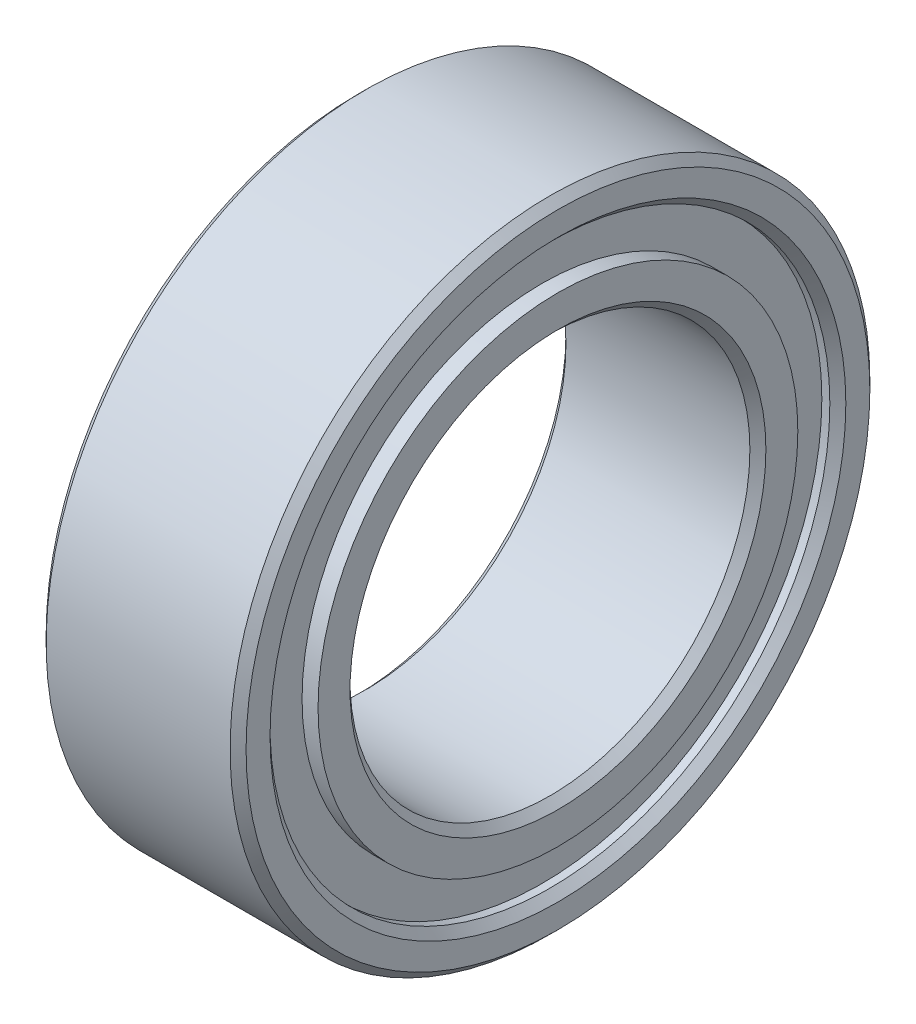
ISO-10303-21;
HEADER;
FILE_DESCRIPTION(('STEP AP214'),'2;1');
FILE_NAME('part.step','',(''),(''),'','','');
FILE_SCHEMA(('AUTOMOTIVE_DESIGN { 1 0 10303 214 1 1 1 1 }'));
ENDSEC;
DATA;
#1=APPLICATION_CONTEXT('core data for automotive mechanical design processes');
#2=APPLICATION_PROTOCOL_DEFINITION('international standard','automotive_design',2000,#1);
#3=PRODUCT_CONTEXT('',#1,'mechanical');
#4=PRODUCT('Part','Part','',(#3));
#5=PRODUCT_RELATED_PRODUCT_CATEGORY('part','',(#4));
#6=PRODUCT_DEFINITION_FORMATION('','',#4);
#7=PRODUCT_DEFINITION_CONTEXT('part definition',#1,'design');
#8=PRODUCT_DEFINITION('design','',#6,#7);
#9=PRODUCT_DEFINITION_SHAPE('','',#8);
#10=(LENGTH_UNIT() NAMED_UNIT(*) SI_UNIT(.MILLI.,.METRE.));
#11=(NAMED_UNIT(*) PLANE_ANGLE_UNIT() SI_UNIT($,.RADIAN.));
#12=(NAMED_UNIT(*) SI_UNIT($,.STERADIAN.) SOLID_ANGLE_UNIT());
#13=UNCERTAINTY_MEASURE_WITH_UNIT(LENGTH_MEASURE(1.E-05),#10,'distance_accuracy_value','');
#14=(GEOMETRIC_REPRESENTATION_CONTEXT(3) GLOBAL_UNCERTAINTY_ASSIGNED_CONTEXT((#13)) GLOBAL_UNIT_ASSIGNED_CONTEXT((#10,
#11,#12)) REPRESENTATION_CONTEXT('',''));
#15=CARTESIAN_POINT('',(0.,0.,0.));
#16=DIRECTION('',(0.,0.,1.));
#17=DIRECTION('',(1.,0.,0.));
#18=AXIS2_PLACEMENT_3D('',#15,#16,#17);
#19=CARTESIAN_POINT('',(0.,0.,0.));
#20=DIRECTION('',(1.,0.,0.));
#21=DIRECTION('',(0.,0.,-1.));
#22=AXIS2_PLACEMENT_3D('',#19,#20,#21);
#23=PLANE('',#22);
#24=CARTESIAN_POINT('',(0.,0.,-0.0491231883012408));
#25=DIRECTION('',(1.,0.,0.));
#26=DIRECTION('',(0.,0.,-1.));
#27=AXIS2_PLACEMENT_3D('',#24,#25,#26);
#28=CIRCLE('',#27,2.85087681169876);
#29=CARTESIAN_POINT('',(0.,0.,-2.9));
#30=VERTEX_POINT('',#29);
#31=EDGE_CURVE('E44',#30,#30,#28,.F.);
#32=ORIENTED_EDGE('',*,*,#31,.T.);
#33=EDGE_LOOP('',(#32));
#34=FACE_BOUND('',#33,.T.);
#35=CARTESIAN_POINT('',(0.,0.,0.));
#36=DIRECTION('',(1.,0.,0.));
#37=DIRECTION('',(0.,0.,-1.));
#38=AXIS2_PLACEMENT_3D('',#35,#36,#37);
#39=CIRCLE('',#38,2.6);
#40=CARTESIAN_POINT('',(0.,0.,-2.6));
#41=VERTEX_POINT('',#40);
#42=EDGE_CURVE('E48',#41,#41,#39,.T.);
#43=ORIENTED_EDGE('',*,*,#42,.T.);
#44=EDGE_LOOP('',(#43));
#45=FACE_BOUND('',#44,.T.);
#46=ADVANCED_FACE('F33',(#34,#45),#23,.F.);
#47=CARTESIAN_POINT('',(2.5,0.,0.));
#48=DIRECTION('',(1.,0.,0.));
#49=DIRECTION('',(0.,0.,-1.));
#50=AXIS2_PLACEMENT_3D('',#47,#48,#49);
#51=PLANE('',#50);
#52=CARTESIAN_POINT('',(2.5,0.,0.));
#53=DIRECTION('',(1.,0.,0.));
#54=DIRECTION('',(0.,0.,-1.));
#55=AXIS2_PLACEMENT_3D('',#52,#53,#54);
#56=CIRCLE('',#55,2.6);
#57=CARTESIAN_POINT('',(2.5,0.,-2.6));
#58=VERTEX_POINT('',#57);
#59=EDGE_CURVE('E62',#58,#58,#56,.F.);
#60=ORIENTED_EDGE('',*,*,#59,.T.);
#61=EDGE_LOOP('',(#60));
#62=FACE_BOUND('',#61,.T.);
#63=CARTESIAN_POINT('',(2.5,0.,0.000375624504543939));
#64=DIRECTION('',(1.,0.,0.));
#65=DIRECTION('',(0.,0.,-1.));
#66=AXIS2_PLACEMENT_3D('',#63,#64,#65);
#67=CIRCLE('',#66,2.99962437549546);
#68=CARTESIAN_POINT('',(2.5,0.,-2.99924875099091));
#69=VERTEX_POINT('',#68);
#70=EDGE_CURVE('E87',#69,#69,#67,.T.);
#71=ORIENTED_EDGE('',*,*,#70,.T.);
#72=EDGE_LOOP('',(#71));
#73=FACE_BOUND('',#72,.T.);
#74=ADVANCED_FACE('F118',(#62,#73),#51,.T.);
#75=CARTESIAN_POINT('',(2.5,0.,0.));
#76=DIRECTION('',(1.,0.,0.));
#77=DIRECTION('',(0.,0.,-1.));
#78=AXIS2_PLACEMENT_3D('',#75,#76,#77);
#79=CIRCLE('',#78,3.9);
#80=CARTESIAN_POINT('',(2.5,0.,-3.9));
#81=VERTEX_POINT('',#80);
#82=EDGE_CURVE('E77',#81,#81,#79,.T.);
#83=ORIENTED_EDGE('',*,*,#82,.T.);
#84=EDGE_LOOP('',(#83));
#85=FACE_BOUND('',#84,.T.);
#86=CARTESIAN_POINT('',(2.5,0.,0.000375624504543939));
#87=DIRECTION('',(1.,0.,0.));
#88=DIRECTION('',(0.,0.,-1.));
#89=AXIS2_PLACEMENT_3D('',#86,#87,#88);
#90=CIRCLE('',#89,3.6);
#91=CARTESIAN_POINT('',(2.5,0.,-3.59962437549546));
#92=VERTEX_POINT('',#91);
#93=EDGE_CURVE('E80',#92,#92,#90,.F.);
#94=ORIENTED_EDGE('',*,*,#93,.T.);
#95=EDGE_LOOP('',(#94));
#96=FACE_BOUND('',#95,.T.);
#97=ADVANCED_FACE('F125',(#85,#96),#51,.T.);
#98=CARTESIAN_POINT('',(0.,0.,0.));
#99=DIRECTION('',(1.,0.,0.));
#100=DIRECTION('',(0.,0.,-1.));
#101=AXIS2_PLACEMENT_3D('',#98,#99,#100);
#102=CIRCLE('',#101,3.9);
#103=CARTESIAN_POINT('',(0.,0.,-3.9));
#104=VERTEX_POINT('',#103);
#105=EDGE_CURVE('E53',#104,#104,#102,.F.);
#106=ORIENTED_EDGE('',*,*,#105,.T.);
#107=EDGE_LOOP('',(#106));
#108=FACE_BOUND('',#107,.T.);
#109=CARTESIAN_POINT('',(0.,0.,-0.0491231883012408));
#110=DIRECTION('',(1.,0.,0.));
#111=DIRECTION('',(0.,0.,-1.));
#112=AXIS2_PLACEMENT_3D('',#109,#110,#111);
#113=CIRCLE('',#112,3.6);
#114=CARTESIAN_POINT('',(0.,0.,-3.64912318830124));
#115=VERTEX_POINT('',#114);
#116=EDGE_CURVE('E56',#115,#115,#113,.T.);
#117=ORIENTED_EDGE('',*,*,#116,.T.);
#118=EDGE_LOOP('',(#117));
#119=FACE_BOUND('',#118,.T.);
#120=ADVANCED_FACE('F121',(#108,#119),#23,.F.);
#121=CARTESIAN_POINT('',(2.5,0.,0.));
#122=DIRECTION('',(-1.,0.,0.));
#123=DIRECTION('',(0.,0.,1.));
#124=AXIS2_PLACEMENT_3D('',#121,#122,#123);
#125=CYLINDRICAL_SURFACE('',#124,4.);
#126=CARTESIAN_POINT('',(2.4,0.,0.));
#127=DIRECTION('',(1.,0.,0.));
#128=DIRECTION('',(0.,0.,-1.));
#129=AXIS2_PLACEMENT_3D('',#126,#127,#128);
#130=CIRCLE('',#129,4.);
#131=CARTESIAN_POINT('',(2.4,0.,-4.));
#132=VERTEX_POINT('',#131);
#133=EDGE_CURVE('E71',#132,#132,#130,.F.);
#134=ORIENTED_EDGE('',*,*,#133,.T.);
#135=EDGE_LOOP('',(#134));
#136=FACE_BOUND('',#135,.T.);
#137=CARTESIAN_POINT('',(0.0999999999999994,0.,0.));
#138=DIRECTION('',(1.,0.,0.));
#139=DIRECTION('',(0.,0.,-1.));
#140=AXIS2_PLACEMENT_3D('',#137,#138,#139);
#141=CIRCLE('',#140,4.);
#142=CARTESIAN_POINT('',(0.0999999999999994,0.,-4.));
#143=VERTEX_POINT('',#142);
#144=EDGE_CURVE('E74',#143,#143,#141,.T.);
#145=ORIENTED_EDGE('',*,*,#144,.T.);
#146=EDGE_LOOP('',(#145));
#147=FACE_BOUND('',#146,.T.);
#148=ADVANCED_FACE('F131',(#136,#147),#125,.T.);
#149=CARTESIAN_POINT('',(2.5,0.,0.));
#150=DIRECTION('',(-1.,0.,0.));
#151=DIRECTION('',(0.,0.,1.));
#152=AXIS2_PLACEMENT_3D('',#149,#150,#151);
#153=CYLINDRICAL_SURFACE('',#152,2.5);
#154=CARTESIAN_POINT('',(2.4,0.,0.));
#155=DIRECTION('',(1.,0.,0.));
#156=DIRECTION('',(0.,0.,-1.));
#157=AXIS2_PLACEMENT_3D('',#154,#155,#156);
#158=CIRCLE('',#157,2.5);
#159=CARTESIAN_POINT('',(2.4,0.,-2.5));
#160=VERTEX_POINT('',#159);
#161=EDGE_CURVE('E65',#160,#160,#158,.T.);
#162=ORIENTED_EDGE('',*,*,#161,.T.);
#163=EDGE_LOOP('',(#162));
#164=FACE_BOUND('',#163,.T.);
#165=CARTESIAN_POINT('',(0.0999999999999994,0.,0.));
#166=DIRECTION('',(1.,0.,0.));
#167=DIRECTION('',(0.,0.,-1.));
#168=AXIS2_PLACEMENT_3D('',#165,#166,#167);
#169=CIRCLE('',#168,2.5);
#170=CARTESIAN_POINT('',(0.0999999999999994,0.,-2.5));
#171=VERTEX_POINT('',#170);
#172=EDGE_CURVE('E68',#171,#171,#169,.F.);
#173=ORIENTED_EDGE('',*,*,#172,.T.);
#174=EDGE_LOOP('',(#173));
#175=FACE_BOUND('',#174,.T.);
#176=ADVANCED_FACE('F137',(#164,#175),#153,.F.);
#177=CARTESIAN_POINT('',(2.3,0.,0.000375624504543939));
#178=DIRECTION('',(1.,0.,0.));
#179=DIRECTION('',(0.,0.,-1.));
#180=AXIS2_PLACEMENT_3D('',#177,#178,#179);
#181=CYLINDRICAL_SURFACE('',#180,3.5);
#182=CARTESIAN_POINT('',(2.4,0.,0.000375624504543939));
#183=DIRECTION('',(1.,0.,0.));
#184=DIRECTION('',(0.,0.,-1.));
#185=AXIS2_PLACEMENT_3D('',#182,#183,#184);
#186=CIRCLE('',#185,3.5);
#187=CARTESIAN_POINT('',(2.4,0.,-3.49962437549546));
#188=VERTEX_POINT('',#187);
#189=EDGE_CURVE('E59',#188,#188,#186,.T.);
#190=ORIENTED_EDGE('',*,*,#189,.T.);
#191=EDGE_LOOP('',(#190));
#192=FACE_BOUND('',#191,.T.);
#193=CARTESIAN_POINT('',(2.3,0.,0.000375624504543939));
#194=DIRECTION('',(1.,0.,0.));
#195=DIRECTION('',(0.,0.,-1.));
#196=AXIS2_PLACEMENT_3D('',#193,#194,#195);
#197=CIRCLE('',#196,3.5);
#198=CARTESIAN_POINT('',(2.3,0.,-3.49962437549546));
#199=VERTEX_POINT('',#198);
#200=EDGE_CURVE('E83',#199,#199,#197,.T.);
#201=ORIENTED_EDGE('',*,*,#200,.F.);
#202=EDGE_LOOP('',(#201));
#203=FACE_BOUND('',#202,.T.);
#204=ADVANCED_FACE('F187',(#192,#203),#181,.F.);
#205=CARTESIAN_POINT('',(2.3,0.,0.000375624504543939));
#206=DIRECTION('',(1.,0.,0.));
#207=DIRECTION('',(0.,0.,-1.));
#208=AXIS2_PLACEMENT_3D('',#205,#206,#207);
#209=PLANE('',#208);
#210=CARTESIAN_POINT('',(2.3,0.,0.000375624504543939));
#211=DIRECTION('',(1.,0.,0.));
#212=DIRECTION('',(0.,0.,-1.));
#213=AXIS2_PLACEMENT_3D('',#210,#211,#212);
#214=CIRCLE('',#213,2.99962437549546);
#215=CARTESIAN_POINT('',(2.3,0.,-2.99924875099091));
#216=VERTEX_POINT('',#215);
#217=EDGE_CURVE('E86',#216,#216,#214,.T.);
#218=ORIENTED_EDGE('',*,*,#217,.F.);
#219=EDGE_LOOP('',(#218));
#220=FACE_BOUND('',#219,.T.);
#221=ORIENTED_EDGE('',*,*,#200,.T.);
#222=EDGE_LOOP('',(#221));
#223=FACE_BOUND('',#222,.T.);
#224=ADVANCED_FACE('F114',(#220,#223),#209,.T.);
#225=CARTESIAN_POINT('',(2.3,0.,0.000375624504543939));
#226=DIRECTION('',(1.,0.,0.));
#227=DIRECTION('',(0.,0.,-1.));
#228=AXIS2_PLACEMENT_3D('',#225,#226,#227);
#229=CYLINDRICAL_SURFACE('',#228,2.99962437549546);
#230=ORIENTED_EDGE('',*,*,#217,.T.);
#231=EDGE_LOOP('',(#230));
#232=FACE_BOUND('',#231,.T.);
#233=ORIENTED_EDGE('',*,*,#70,.F.);
#234=EDGE_LOOP('',(#233));
#235=FACE_BOUND('',#234,.T.);
#236=ADVANCED_FACE('F109',(#232,#235),#229,.T.);
#237=CARTESIAN_POINT('',(0.2,0.,-0.0491231883012408));
#238=DIRECTION('',(-1.,0.,0.));
#239=DIRECTION('',(0.,0.,1.));
#240=AXIS2_PLACEMENT_3D('',#237,#238,#239);
#241=CYLINDRICAL_SURFACE('',#240,3.5);
#242=CARTESIAN_POINT('',(0.100000000000001,0.,-0.0491231883012408));
#243=DIRECTION('',(1.,0.,0.));
#244=DIRECTION('',(0.,0.,-1.));
#245=AXIS2_PLACEMENT_3D('',#242,#243,#244);
#246=CIRCLE('',#245,3.5);
#247=CARTESIAN_POINT('',(0.100000000000001,0.,-3.54912318830124));
#248=VERTEX_POINT('',#247);
#249=EDGE_CURVE('E10',#248,#248,#246,.F.);
#250=ORIENTED_EDGE('',*,*,#249,.T.);
#251=EDGE_LOOP('',(#250));
#252=FACE_BOUND('',#251,.T.);
#253=CARTESIAN_POINT('',(0.2,0.,-0.0491231883012408));
#254=DIRECTION('',(-1.,0.,0.));
#255=DIRECTION('',(0.,0.,1.));
#256=AXIS2_PLACEMENT_3D('',#253,#254,#255);
#257=CIRCLE('',#256,3.5);
#258=CARTESIAN_POINT('',(0.2,0.,3.45087681169876));
#259=VERTEX_POINT('',#258);
#260=EDGE_CURVE('E90',#259,#259,#257,.T.);
#261=ORIENTED_EDGE('',*,*,#260,.F.);
#262=EDGE_LOOP('',(#261));
#263=FACE_BOUND('',#262,.T.);
#264=ADVANCED_FACE('F104',(#252,#263),#241,.F.);
#265=CARTESIAN_POINT('',(0.2,0.,-0.0491231883012408));
#266=DIRECTION('',(-1.,0.,0.));
#267=DIRECTION('',(0.,0.,1.));
#268=AXIS2_PLACEMENT_3D('',#265,#266,#267);
#269=PLANE('',#268);
#270=CARTESIAN_POINT('',(0.2,0.,-0.0491231883012408));
#271=DIRECTION('',(-1.,0.,0.));
#272=DIRECTION('',(0.,0.,1.));
#273=AXIS2_PLACEMENT_3D('',#270,#271,#272);
#274=CIRCLE('',#273,2.95087681169876);
#275=CARTESIAN_POINT('',(0.2,0.,2.90175362339752));
#276=VERTEX_POINT('',#275);
#277=EDGE_CURVE('E95',#276,#276,#274,.T.);
#278=ORIENTED_EDGE('',*,*,#277,.F.);
#279=EDGE_LOOP('',(#278));
#280=FACE_BOUND('',#279,.T.);
#281=ORIENTED_EDGE('',*,*,#260,.T.);
#282=EDGE_LOOP('',(#281));
#283=FACE_BOUND('',#282,.T.);
#284=ADVANCED_FACE('F101',(#280,#283),#269,.T.);
#285=CARTESIAN_POINT('',(0.2,0.,-0.0491231883012408));
#286=DIRECTION('',(-1.,0.,0.));
#287=DIRECTION('',(0.,0.,1.));
#288=AXIS2_PLACEMENT_3D('',#285,#286,#287);
#289=CYLINDRICAL_SURFACE('',#288,2.95087681169876);
#290=CARTESIAN_POINT('',(0.100000000000002,0.,-0.0491231883012408));
#291=DIRECTION('',(1.,0.,0.));
#292=DIRECTION('',(0.,0.,-1.));
#293=AXIS2_PLACEMENT_3D('',#290,#291,#292);
#294=CIRCLE('',#293,2.95087681169876);
#295=CARTESIAN_POINT('',(0.100000000000002,0.,-3.));
#296=VERTEX_POINT('',#295);
#297=EDGE_CURVE('E40',#296,#296,#294,.T.);
#298=ORIENTED_EDGE('',*,*,#297,.T.);
#299=EDGE_LOOP('',(#298));
#300=FACE_BOUND('',#299,.T.);
#301=ORIENTED_EDGE('',*,*,#277,.T.);
#302=EDGE_LOOP('',(#301));
#303=FACE_BOUND('',#302,.T.);
#304=ADVANCED_FACE('F99',(#300,#303),#289,.T.);
#305=CARTESIAN_POINT('',(2.5,0.,0.));
#306=DIRECTION('',(-1.,0.,0.));
#307=DIRECTION('',(0.,0.,1.));
#308=AXIS2_PLACEMENT_3D('',#305,#306,#307);
#309=CONICAL_SURFACE('',#308,3.9,0.785398163397448);
#310=ORIENTED_EDGE('',*,*,#133,.F.);
#311=EDGE_LOOP('',(#310));
#312=FACE_BOUND('',#311,.T.);
#313=ORIENTED_EDGE('',*,*,#82,.F.);
#314=EDGE_LOOP('',(#313));
#315=FACE_BOUND('',#314,.T.);
#316=ADVANCED_FACE('F171',(#312,#315),#309,.T.);
#317=CARTESIAN_POINT('',(2.4,0.,0.));
#318=DIRECTION('',(1.,0.,0.));
#319=DIRECTION('',(0.,0.,-1.));
#320=AXIS2_PLACEMENT_3D('',#317,#318,#319);
#321=CONICAL_SURFACE('',#320,2.5,0.78539816339745);
#322=ORIENTED_EDGE('',*,*,#59,.F.);
#323=EDGE_LOOP('',(#322));
#324=FACE_BOUND('',#323,.T.);
#325=ORIENTED_EDGE('',*,*,#161,.F.);
#326=EDGE_LOOP('',(#325));
#327=FACE_BOUND('',#326,.T.);
#328=ADVANCED_FACE('F167',(#324,#327),#321,.F.);
#329=CARTESIAN_POINT('',(2.4,0.,0.000375624504543939));
#330=DIRECTION('',(1.,0.,0.));
#331=DIRECTION('',(0.,0.,-1.));
#332=AXIS2_PLACEMENT_3D('',#329,#330,#331);
#333=CONICAL_SURFACE('',#332,3.5,0.785398163397453);
#334=ORIENTED_EDGE('',*,*,#93,.F.);
#335=EDGE_LOOP('',(#334));
#336=FACE_BOUND('',#335,.T.);
#337=ORIENTED_EDGE('',*,*,#189,.F.);
#338=EDGE_LOOP('',(#337));
#339=FACE_BOUND('',#338,.T.);
#340=ADVANCED_FACE('F163',(#336,#339),#333,.F.);
#341=CARTESIAN_POINT('',(0.0999999999999994,0.,0.));
#342=DIRECTION('',(1.,0.,0.));
#343=DIRECTION('',(0.,0.,-1.));
#344=AXIS2_PLACEMENT_3D('',#341,#342,#343);
#345=CONICAL_SURFACE('',#344,4.,0.785398163397444);
#346=ORIENTED_EDGE('',*,*,#105,.F.);
#347=EDGE_LOOP('',(#346));
#348=FACE_BOUND('',#347,.T.);
#349=ORIENTED_EDGE('',*,*,#144,.F.);
#350=EDGE_LOOP('',(#349));
#351=FACE_BOUND('',#350,.T.);
#352=ADVANCED_FACE('F155',(#348,#351),#345,.T.);
#353=CARTESIAN_POINT('',(0.,0.,-0.0491231883012408));
#354=DIRECTION('',(1.,0.,0.));
#355=DIRECTION('',(0.,0.,-1.));
#356=AXIS2_PLACEMENT_3D('',#353,#354,#355);
#357=CONICAL_SURFACE('',#356,2.85087681169876,0.785398163397443);
#358=ORIENTED_EDGE('',*,*,#297,.F.);
#359=EDGE_LOOP('',(#358));
#360=FACE_BOUND('',#359,.T.);
#361=ORIENTED_EDGE('',*,*,#31,.F.);
#362=EDGE_LOOP('',(#361));
#363=FACE_BOUND('',#362,.T.);
#364=ADVANCED_FACE('F150',(#360,#363),#357,.T.);
#365=CARTESIAN_POINT('',(0.,0.,0.));
#366=DIRECTION('',(-1.,0.,0.));
#367=DIRECTION('',(0.,0.,1.));
#368=AXIS2_PLACEMENT_3D('',#365,#366,#367);
#369=CONICAL_SURFACE('',#368,2.6,0.785398163397446);
#370=ORIENTED_EDGE('',*,*,#172,.F.);
#371=EDGE_LOOP('',(#370));
#372=FACE_BOUND('',#371,.T.);
#373=ORIENTED_EDGE('',*,*,#42,.F.);
#374=EDGE_LOOP('',(#373));
#375=FACE_BOUND('',#374,.T.);
#376=ADVANCED_FACE('F146',(#372,#375),#369,.F.);
#377=CARTESIAN_POINT('',(0.100000000000001,0.,-0.0491231883012408));
#378=DIRECTION('',(-1.,0.,0.));
#379=DIRECTION('',(0.,0.,1.));
#380=AXIS2_PLACEMENT_3D('',#377,#378,#379);
#381=CONICAL_SURFACE('',#380,3.5,0.785398163397452);
#382=ORIENTED_EDGE('',*,*,#116,.F.);
#383=EDGE_LOOP('',(#382));
#384=FACE_BOUND('',#383,.T.);
#385=ORIENTED_EDGE('',*,*,#249,.F.);
#386=EDGE_LOOP('',(#385));
#387=FACE_BOUND('',#386,.T.);
#388=ADVANCED_FACE('F35',(#384,#387),#381,.F.);
#389=CLOSED_SHELL('',(#46,#74,#97,#120,#148,#176,#204,#224,#236,#264,#284,#304,#316,#328,#340,
#352,#364,#376,#388));
#390=MANIFOLD_SOLID_BREP('B2',#389);
#391=ADVANCED_BREP_SHAPE_REPRESENTATION('',(#18,#390),#14);
#392=SHAPE_DEFINITION_REPRESENTATION(#9,#391);
ENDSEC;
END-ISO-10303-21;
